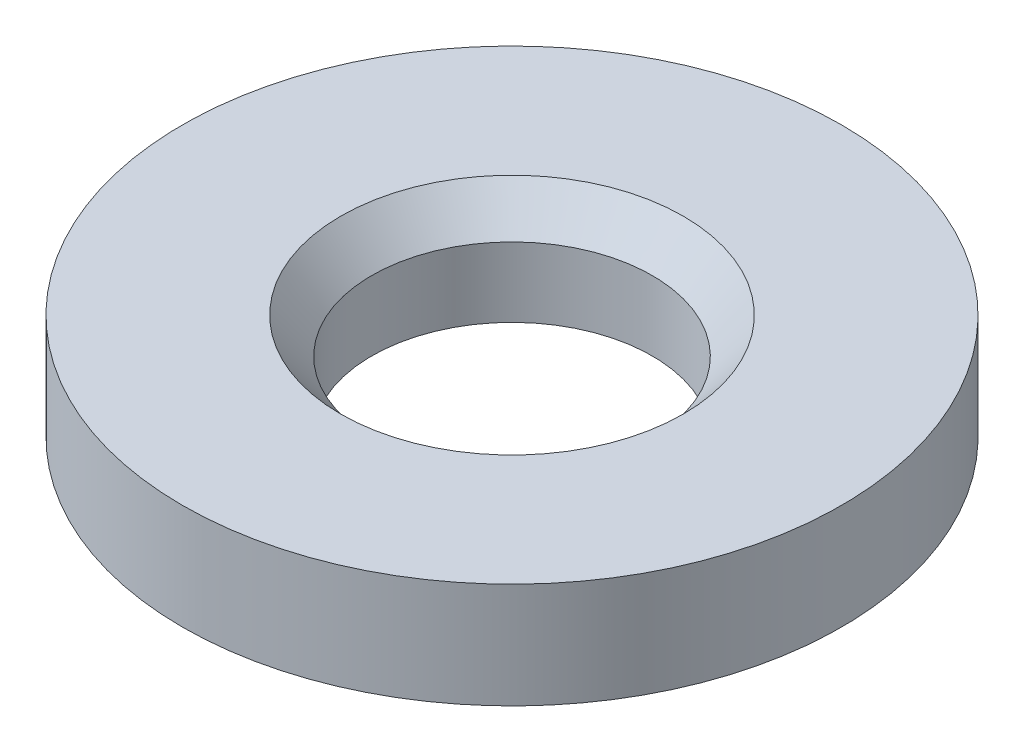
ISO-10303-21;
HEADER;
FILE_DESCRIPTION(('STEP AP214'),'2;1');
FILE_NAME('part.step','',(''),(''),'','','');
FILE_SCHEMA(('AUTOMOTIVE_DESIGN { 1 0 10303 214 1 1 1 1 }'));
ENDSEC;
DATA;
#1=APPLICATION_CONTEXT('core data for automotive mechanical design processes');
#2=APPLICATION_PROTOCOL_DEFINITION('international standard','automotive_design',2000,#1);
#3=PRODUCT_CONTEXT('',#1,'mechanical');
#4=PRODUCT('Part','Part','',(#3));
#5=PRODUCT_RELATED_PRODUCT_CATEGORY('part','',(#4));
#6=PRODUCT_DEFINITION_FORMATION('','',#4);
#7=PRODUCT_DEFINITION_CONTEXT('part definition',#1,'design');
#8=PRODUCT_DEFINITION('design','',#6,#7);
#9=PRODUCT_DEFINITION_SHAPE('','',#8);
#10=(LENGTH_UNIT() NAMED_UNIT(*) SI_UNIT(.MILLI.,.METRE.));
#11=(NAMED_UNIT(*) PLANE_ANGLE_UNIT() SI_UNIT($,.RADIAN.));
#12=(NAMED_UNIT(*) SI_UNIT($,.STERADIAN.) SOLID_ANGLE_UNIT());
#13=UNCERTAINTY_MEASURE_WITH_UNIT(LENGTH_MEASURE(1.E-05),#10,'distance_accuracy_value','');
#14=(GEOMETRIC_REPRESENTATION_CONTEXT(3) GLOBAL_UNCERTAINTY_ASSIGNED_CONTEXT((#13)) GLOBAL_UNIT_ASSIGNED_CONTEXT((#10,
#11,#12)) REPRESENTATION_CONTEXT('',''));
#15=CARTESIAN_POINT('',(0.,0.,0.));
#16=DIRECTION('',(0.,0.,1.));
#17=DIRECTION('',(1.,0.,0.));
#18=AXIS2_PLACEMENT_3D('',#15,#16,#17);
#19=CARTESIAN_POINT('',(0.,2.54,0.));
#20=DIRECTION('',(0.,-1.,0.));
#21=DIRECTION('',(0.,0.,-1.));
#22=AXIS2_PLACEMENT_3D('',#19,#20,#21);
#23=CYLINDRICAL_SURFACE('',#22,7.9375);
#24=CARTESIAN_POINT('',(0.,2.54,0.));
#25=DIRECTION('',(0.,1.,0.));
#26=DIRECTION('',(0.,0.,1.));
#27=AXIS2_PLACEMENT_3D('',#24,#25,#26);
#28=CIRCLE('',#27,7.9375);
#29=CARTESIAN_POINT('',(0.,2.54,7.9375));
#30=VERTEX_POINT('',#29);
#31=EDGE_CURVE('E10',#30,#30,#28,.T.);
#32=ORIENTED_EDGE('',*,*,#31,.F.);
#33=EDGE_LOOP('',(#32));
#34=FACE_BOUND('',#33,.T.);
#35=CARTESIAN_POINT('',(0.,0.,0.));
#36=DIRECTION('',(0.,1.,0.));
#37=DIRECTION('',(0.,0.,1.));
#38=AXIS2_PLACEMENT_3D('',#35,#36,#37);
#39=CIRCLE('',#38,7.9375);
#40=CARTESIAN_POINT('',(0.,0.,7.9375));
#41=VERTEX_POINT('',#40);
#42=EDGE_CURVE('E40',#41,#41,#39,.T.);
#43=ORIENTED_EDGE('',*,*,#42,.T.);
#44=EDGE_LOOP('',(#43));
#45=FACE_BOUND('',#44,.T.);
#46=ADVANCED_FACE('F37',(#34,#45),#23,.T.);
#47=CARTESIAN_POINT('',(0.,2.54,0.));
#48=DIRECTION('',(0.,1.,0.));
#49=DIRECTION('',(0.,0.,1.));
#50=AXIS2_PLACEMENT_3D('',#47,#48,#49);
#51=PLANE('',#50);
#52=CARTESIAN_POINT('',(0.,2.54,0.));
#53=DIRECTION('',(0.,1.,0.));
#54=DIRECTION('',(0.,0.,1.));
#55=AXIS2_PLACEMENT_3D('',#52,#53,#54);
#56=CIRCLE('',#55,4.1275);
#57=CARTESIAN_POINT('',(0.,2.54,4.1275));
#58=VERTEX_POINT('',#57);
#59=EDGE_CURVE('E54',#58,#58,#56,.T.);
#60=ORIENTED_EDGE('',*,*,#59,.F.);
#61=EDGE_LOOP('',(#60));
#62=FACE_BOUND('',#61,.T.);
#63=ORIENTED_EDGE('',*,*,#31,.T.);
#64=EDGE_LOOP('',(#63));
#65=FACE_BOUND('',#64,.T.);
#66=ADVANCED_FACE('F60',(#62,#65),#51,.T.);
#67=CARTESIAN_POINT('',(0.,0.,0.));
#68=DIRECTION('',(0.,1.,0.));
#69=DIRECTION('',(0.,0.,1.));
#70=AXIS2_PLACEMENT_3D('',#67,#68,#69);
#71=PLANE('',#70);
#72=CARTESIAN_POINT('',(0.,0.,0.));
#73=DIRECTION('',(0.,1.,0.));
#74=DIRECTION('',(0.,0.,1.));
#75=AXIS2_PLACEMENT_3D('',#72,#73,#74);
#76=CIRCLE('',#75,3.3782);
#77=CARTESIAN_POINT('',(0.,0.,3.3782));
#78=VERTEX_POINT('',#77);
#79=EDGE_CURVE('E47',#78,#78,#76,.T.);
#80=ORIENTED_EDGE('',*,*,#79,.T.);
#81=EDGE_LOOP('',(#80));
#82=FACE_BOUND('',#81,.T.);
#83=ORIENTED_EDGE('',*,*,#42,.F.);
#84=EDGE_LOOP('',(#83));
#85=FACE_BOUND('',#84,.T.);
#86=ADVANCED_FACE('F62',(#82,#85),#71,.F.);
#87=CARTESIAN_POINT('',(0.,2.54,0.));
#88=DIRECTION('',(0.,1.,0.));
#89=DIRECTION('',(0.,0.,1.));
#90=AXIS2_PLACEMENT_3D('',#87,#88,#89);
#91=CYLINDRICAL_SURFACE('',#90,3.3782);
#92=ORIENTED_EDGE('',*,*,#79,.F.);
#93=EDGE_LOOP('',(#92));
#94=FACE_BOUND('',#93,.T.);
#95=CARTESIAN_POINT('',(0.,1.6780289524693,0.));
#96=DIRECTION('',(0.,1.,0.));
#97=DIRECTION('',(0.,0.,1.));
#98=AXIS2_PLACEMENT_3D('',#95,#96,#97);
#99=CIRCLE('',#98,3.3782);
#100=CARTESIAN_POINT('',(0.,1.6780289524693,3.3782));
#101=VERTEX_POINT('',#100);
#102=EDGE_CURVE('E51',#101,#101,#99,.T.);
#103=ORIENTED_EDGE('',*,*,#102,.T.);
#104=EDGE_LOOP('',(#103));
#105=FACE_BOUND('',#104,.T.);
#106=ADVANCED_FACE('F68',(#94,#105),#91,.F.);
#107=CARTESIAN_POINT('',(0.,2.54,0.));
#108=DIRECTION('',(0.,1.,0.));
#109=DIRECTION('',(0.,0.,1.));
#110=AXIS2_PLACEMENT_3D('',#107,#108,#109);
#111=CONICAL_SURFACE('',#110,4.1275,0.715584993317676);
#112=ORIENTED_EDGE('',*,*,#102,.F.);
#113=EDGE_LOOP('',(#112));
#114=FACE_BOUND('',#113,.T.);
#115=ORIENTED_EDGE('',*,*,#59,.T.);
#116=EDGE_LOOP('',(#115));
#117=FACE_BOUND('',#116,.T.);
#118=ADVANCED_FACE('F58',(#114,#117),#111,.F.);
#119=CLOSED_SHELL('',(#46,#66,#86,#106,#118));
#120=MANIFOLD_SOLID_BREP('B2',#119);
#121=ADVANCED_BREP_SHAPE_REPRESENTATION('',(#18,#120),#14);
#122=SHAPE_DEFINITION_REPRESENTATION(#9,#121);
ENDSEC;
END-ISO-10303-21;
